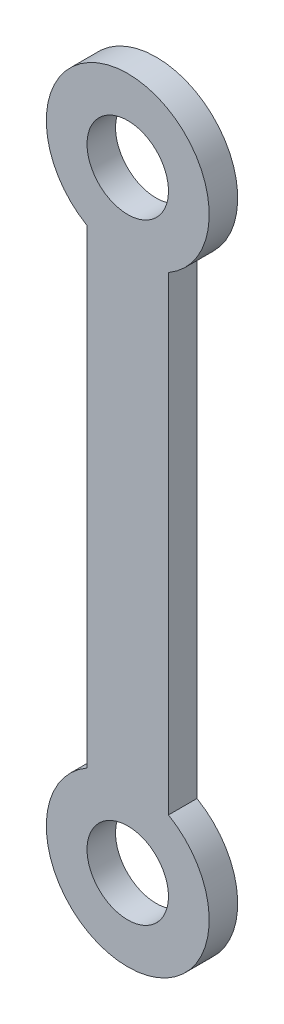
ISO-10303-21;
HEADER;
FILE_DESCRIPTION(('STEP AP214'),'2;1');
FILE_NAME('part.step','',(''),(''),'','','');
FILE_SCHEMA(('AUTOMOTIVE_DESIGN { 1 0 10303 214 1 1 1 1 }'));
ENDSEC;
DATA;
#1=APPLICATION_CONTEXT('core data for automotive mechanical design processes');
#2=APPLICATION_PROTOCOL_DEFINITION('international standard','automotive_design',2000,#1);
#3=PRODUCT_CONTEXT('',#1,'mechanical');
#4=PRODUCT('Part','Part','',(#3));
#5=PRODUCT_RELATED_PRODUCT_CATEGORY('part','',(#4));
#6=PRODUCT_DEFINITION_FORMATION('','',#4);
#7=PRODUCT_DEFINITION_CONTEXT('part definition',#1,'design');
#8=PRODUCT_DEFINITION('design','',#6,#7);
#9=PRODUCT_DEFINITION_SHAPE('','',#8);
#10=(LENGTH_UNIT() NAMED_UNIT(*) SI_UNIT(.MILLI.,.METRE.));
#11=(NAMED_UNIT(*) PLANE_ANGLE_UNIT() SI_UNIT($,.RADIAN.));
#12=(NAMED_UNIT(*) SI_UNIT($,.STERADIAN.) SOLID_ANGLE_UNIT());
#13=UNCERTAINTY_MEASURE_WITH_UNIT(LENGTH_MEASURE(1.E-05),#10,'distance_accuracy_value','');
#14=(GEOMETRIC_REPRESENTATION_CONTEXT(3) GLOBAL_UNCERTAINTY_ASSIGNED_CONTEXT((#13)) GLOBAL_UNIT_ASSIGNED_CONTEXT((#10,
#11,#12)) REPRESENTATION_CONTEXT('',''));
#15=CARTESIAN_POINT('',(0.,0.,0.));
#16=DIRECTION('',(0.,0.,1.));
#17=DIRECTION('',(1.,0.,0.));
#18=AXIS2_PLACEMENT_3D('',#15,#16,#17);
#19=CARTESIAN_POINT('',(0.,0.,1.4));
#20=DIRECTION('',(0.,0.,-1.));
#21=DIRECTION('',(-1.,0.,0.));
#22=AXIS2_PLACEMENT_3D('',#19,#20,#21);
#23=PLANE('',#22);
#24=CARTESIAN_POINT('',(0.,0.,1.4));
#25=DIRECTION('',(0.,0.,1.));
#26=DIRECTION('',(-1.,0.,0.));
#27=AXIS2_PLACEMENT_3D('',#24,#25,#26);
#28=CIRCLE('',#27,4.);
#29=CARTESIAN_POINT('',(-2.,3.46410161513776,1.4));
#30=VERTEX_POINT('',#29);
#31=CARTESIAN_POINT('',(2.,3.46410161513776,1.4));
#32=VERTEX_POINT('',#31);
#33=EDGE_CURVE('E92',#30,#32,#28,.T.);
#34=ORIENTED_EDGE('',*,*,#33,.T.);
#35=DIRECTION('',(0.,1.,0.));
#36=VECTOR('',#35,1.);
#37=CARTESIAN_POINT('',(2.,26.5358983848622,1.4));
#38=LINE('',#37,#36);
#39=CARTESIAN_POINT('',(1.99999999999999,26.5358983848622,1.4));
#40=VERTEX_POINT('',#39);
#41=EDGE_CURVE('E87',#32,#40,#38,.T.);
#42=ORIENTED_EDGE('',*,*,#41,.T.);
#43=CARTESIAN_POINT('',(0.,30.,1.4));
#44=DIRECTION('',(0.,0.,1.));
#45=DIRECTION('',(1.,0.,0.));
#46=AXIS2_PLACEMENT_3D('',#43,#44,#45);
#47=CIRCLE('',#46,4.);
#48=CARTESIAN_POINT('',(-2.,26.5358983848622,1.4));
#49=VERTEX_POINT('',#48);
#50=EDGE_CURVE('E90',#40,#49,#47,.T.);
#51=ORIENTED_EDGE('',*,*,#50,.T.);
#52=DIRECTION('',(0.,-1.,0.));
#53=VECTOR('',#52,1.);
#54=CARTESIAN_POINT('',(-2.,26.5358983848622,1.4));
#55=LINE('',#54,#53);
#56=EDGE_CURVE('E57',#49,#30,#55,.T.);
#57=ORIENTED_EDGE('',*,*,#56,.T.);
#58=EDGE_LOOP('',(#34,#42,#51,#57));
#59=FACE_BOUND('',#58,.T.);
#60=CARTESIAN_POINT('',(0.,0.,1.4));
#61=DIRECTION('',(0.,0.,1.));
#62=DIRECTION('',(1.,0.,0.));
#63=AXIS2_PLACEMENT_3D('',#60,#61,#62);
#64=CIRCLE('',#63,2.);
#65=CARTESIAN_POINT('',(2.,0.,1.4));
#66=VERTEX_POINT('',#65);
#67=EDGE_CURVE('E112',#66,#66,#64,.T.);
#68=ORIENTED_EDGE('',*,*,#67,.F.);
#69=EDGE_LOOP('',(#68));
#70=FACE_BOUND('',#69,.T.);
#71=CARTESIAN_POINT('',(0.,30.,1.4));
#72=DIRECTION('',(0.,0.,1.));
#73=DIRECTION('',(-1.,0.,0.));
#74=AXIS2_PLACEMENT_3D('',#71,#72,#73);
#75=CIRCLE('',#74,2.);
#76=CARTESIAN_POINT('',(-2.00000000000001,30.,1.4));
#77=VERTEX_POINT('',#76);
#78=EDGE_CURVE('E134',#77,#77,#75,.T.);
#79=ORIENTED_EDGE('',*,*,#78,.F.);
#80=EDGE_LOOP('',(#79));
#81=FACE_BOUND('',#80,.T.);
#82=ADVANCED_FACE('F39',(#59,#70,#81),#23,.F.);
#83=CARTESIAN_POINT('',(0.,0.,0.));
#84=DIRECTION('',(0.,0.,-1.));
#85=DIRECTION('',(-1.,0.,0.));
#86=AXIS2_PLACEMENT_3D('',#83,#84,#85);
#87=PLANE('',#86);
#88=CARTESIAN_POINT('',(0.,0.,0.));
#89=DIRECTION('',(0.,0.,1.));
#90=DIRECTION('',(1.,0.,0.));
#91=AXIS2_PLACEMENT_3D('',#88,#89,#90);
#92=CIRCLE('',#91,2.);
#93=CARTESIAN_POINT('',(2.,0.,0.));
#94=VERTEX_POINT('',#93);
#95=EDGE_CURVE('E130',#94,#94,#92,.T.);
#96=ORIENTED_EDGE('',*,*,#95,.T.);
#97=EDGE_LOOP('',(#96));
#98=FACE_BOUND('',#97,.T.);
#99=CARTESIAN_POINT('',(0.,0.,0.));
#100=DIRECTION('',(0.,0.,1.));
#101=DIRECTION('',(-1.,0.,0.));
#102=AXIS2_PLACEMENT_3D('',#99,#100,#101);
#103=CIRCLE('',#102,4.);
#104=CARTESIAN_POINT('',(-2.,3.46410161513776,0.));
#105=VERTEX_POINT('',#104);
#106=CARTESIAN_POINT('',(2.,3.46410161513776,0.));
#107=VERTEX_POINT('',#106);
#108=EDGE_CURVE('E108',#105,#107,#103,.T.);
#109=ORIENTED_EDGE('',*,*,#108,.F.);
#110=DIRECTION('',(0.,-1.,0.));
#111=VECTOR('',#110,1.);
#112=CARTESIAN_POINT('',(-2.,26.5358983848622,0.));
#113=LINE('',#112,#111);
#114=CARTESIAN_POINT('',(-2.,26.5358983848622,0.));
#115=VERTEX_POINT('',#114);
#116=EDGE_CURVE('E80',#115,#105,#113,.T.);
#117=ORIENTED_EDGE('',*,*,#116,.F.);
#118=CARTESIAN_POINT('',(0.,30.,0.));
#119=DIRECTION('',(0.,0.,1.));
#120=DIRECTION('',(1.,0.,0.));
#121=AXIS2_PLACEMENT_3D('',#118,#119,#120);
#122=CIRCLE('',#121,4.);
#123=CARTESIAN_POINT('',(1.99999999999999,26.5358983848622,0.));
#124=VERTEX_POINT('',#123);
#125=EDGE_CURVE('E74',#124,#115,#122,.T.);
#126=ORIENTED_EDGE('',*,*,#125,.F.);
#127=DIRECTION('',(0.,1.,0.));
#128=VECTOR('',#127,1.);
#129=CARTESIAN_POINT('',(2.,26.5358983848622,0.));
#130=LINE('',#129,#128);
#131=EDGE_CURVE('E97',#107,#124,#130,.T.);
#132=ORIENTED_EDGE('',*,*,#131,.F.);
#133=EDGE_LOOP('',(#109,#117,#126,#132));
#134=FACE_BOUND('',#133,.T.);
#135=CARTESIAN_POINT('',(0.,30.,0.));
#136=DIRECTION('',(0.,0.,1.));
#137=DIRECTION('',(-1.,0.,0.));
#138=AXIS2_PLACEMENT_3D('',#135,#136,#137);
#139=CIRCLE('',#138,2.);
#140=CARTESIAN_POINT('',(-2.00000000000001,30.,0.));
#141=VERTEX_POINT('',#140);
#142=EDGE_CURVE('E138',#141,#141,#139,.T.);
#143=ORIENTED_EDGE('',*,*,#142,.T.);
#144=EDGE_LOOP('',(#143));
#145=FACE_BOUND('',#144,.T.);
#146=ADVANCED_FACE('F125',(#98,#134,#145),#87,.T.);
#147=CARTESIAN_POINT('',(0.,0.,1.4));
#148=DIRECTION('',(0.,0.,-1.));
#149=DIRECTION('',(-1.,0.,0.));
#150=AXIS2_PLACEMENT_3D('',#147,#148,#149);
#151=CYLINDRICAL_SURFACE('',#150,4.);
#152=ORIENTED_EDGE('',*,*,#108,.T.);
#153=DIRECTION('',(0.,0.,-1.));
#154=VECTOR('',#153,1.);
#155=CARTESIAN_POINT('',(2.,3.46410161513776,1.4));
#156=LINE('',#155,#154);
#157=EDGE_CURVE('E11',#32,#107,#156,.T.);
#158=ORIENTED_EDGE('',*,*,#157,.F.);
#159=ORIENTED_EDGE('',*,*,#33,.F.);
#160=DIRECTION('',(0.,0.,-1.));
#161=VECTOR('',#160,1.);
#162=CARTESIAN_POINT('',(-2.,3.46410161513776,1.4));
#163=LINE('',#162,#161);
#164=EDGE_CURVE('E104',#30,#105,#163,.T.);
#165=ORIENTED_EDGE('',*,*,#164,.T.);
#166=EDGE_LOOP('',(#152,#158,#159,#165));
#167=FACE_BOUND('',#166,.T.);
#168=ADVANCED_FACE('F41',(#167),#151,.T.);
#169=CARTESIAN_POINT('',(2.,26.5358983848622,1.4));
#170=DIRECTION('',(-1.,0.,0.));
#171=DIRECTION('',(0.,-1.,0.));
#172=AXIS2_PLACEMENT_3D('',#169,#170,#171);
#173=PLANE('',#172);
#174=ORIENTED_EDGE('',*,*,#131,.T.);
#175=DIRECTION('',(0.,0.,-1.));
#176=VECTOR('',#175,1.);
#177=CARTESIAN_POINT('',(1.99999999999999,26.5358983848622,1.4));
#178=LINE('',#177,#176);
#179=EDGE_CURVE('E49',#40,#124,#178,.T.);
#180=ORIENTED_EDGE('',*,*,#179,.F.);
#181=ORIENTED_EDGE('',*,*,#41,.F.);
#182=ORIENTED_EDGE('',*,*,#157,.T.);
#183=EDGE_LOOP('',(#174,#180,#181,#182));
#184=FACE_BOUND('',#183,.T.);
#185=ADVANCED_FACE('F96',(#184),#173,.F.);
#186=CARTESIAN_POINT('',(0.,30.,1.4));
#187=DIRECTION('',(0.,0.,-1.));
#188=DIRECTION('',(-1.,0.,0.));
#189=AXIS2_PLACEMENT_3D('',#186,#187,#188);
#190=CYLINDRICAL_SURFACE('',#189,4.);
#191=ORIENTED_EDGE('',*,*,#125,.T.);
#192=DIRECTION('',(0.,0.,-1.));
#193=VECTOR('',#192,1.);
#194=CARTESIAN_POINT('',(-2.,26.5358983848622,1.4));
#195=LINE('',#194,#193);
#196=EDGE_CURVE('E99',#49,#115,#195,.T.);
#197=ORIENTED_EDGE('',*,*,#196,.F.);
#198=ORIENTED_EDGE('',*,*,#50,.F.);
#199=ORIENTED_EDGE('',*,*,#179,.T.);
#200=EDGE_LOOP('',(#191,#197,#198,#199));
#201=FACE_BOUND('',#200,.T.);
#202=ADVANCED_FACE('F100',(#201),#190,.T.);
#203=CARTESIAN_POINT('',(-2.,26.5358983848622,1.4));
#204=DIRECTION('',(1.,0.,0.));
#205=DIRECTION('',(0.,1.,0.));
#206=AXIS2_PLACEMENT_3D('',#203,#204,#205);
#207=PLANE('',#206);
#208=ORIENTED_EDGE('',*,*,#116,.T.);
#209=ORIENTED_EDGE('',*,*,#164,.F.);
#210=ORIENTED_EDGE('',*,*,#56,.F.);
#211=ORIENTED_EDGE('',*,*,#196,.T.);
#212=EDGE_LOOP('',(#208,#209,#210,#211));
#213=FACE_BOUND('',#212,.T.);
#214=ADVANCED_FACE('F122',(#213),#207,.F.);
#215=CARTESIAN_POINT('',(0.,0.,1.4));
#216=DIRECTION('',(0.,0.,-1.));
#217=DIRECTION('',(-1.,0.,0.));
#218=AXIS2_PLACEMENT_3D('',#215,#216,#217);
#219=CYLINDRICAL_SURFACE('',#218,2.);
#220=ORIENTED_EDGE('',*,*,#67,.T.);
#221=EDGE_LOOP('',(#220));
#222=FACE_BOUND('',#221,.T.);
#223=ORIENTED_EDGE('',*,*,#95,.F.);
#224=EDGE_LOOP('',(#223));
#225=FACE_BOUND('',#224,.T.);
#226=ADVANCED_FACE('F157',(#222,#225),#219,.F.);
#227=CARTESIAN_POINT('',(0.,30.,1.4));
#228=DIRECTION('',(0.,0.,-1.));
#229=DIRECTION('',(-1.,0.,0.));
#230=AXIS2_PLACEMENT_3D('',#227,#228,#229);
#231=CYLINDRICAL_SURFACE('',#230,2.);
#232=ORIENTED_EDGE('',*,*,#78,.T.);
#233=EDGE_LOOP('',(#232));
#234=FACE_BOUND('',#233,.T.);
#235=ORIENTED_EDGE('',*,*,#142,.F.);
#236=EDGE_LOOP('',(#235));
#237=FACE_BOUND('',#236,.T.);
#238=ADVANCED_FACE('F146',(#234,#237),#231,.F.);
#239=CLOSED_SHELL('',(#82,#146,#168,#185,#202,#214,#226,#238));
#240=MANIFOLD_SOLID_BREP('B2',#239);
#241=ADVANCED_BREP_SHAPE_REPRESENTATION('',(#18,#240),#14);
#242=SHAPE_DEFINITION_REPRESENTATION(#9,#241);
ENDSEC;
END-ISO-10303-21;
